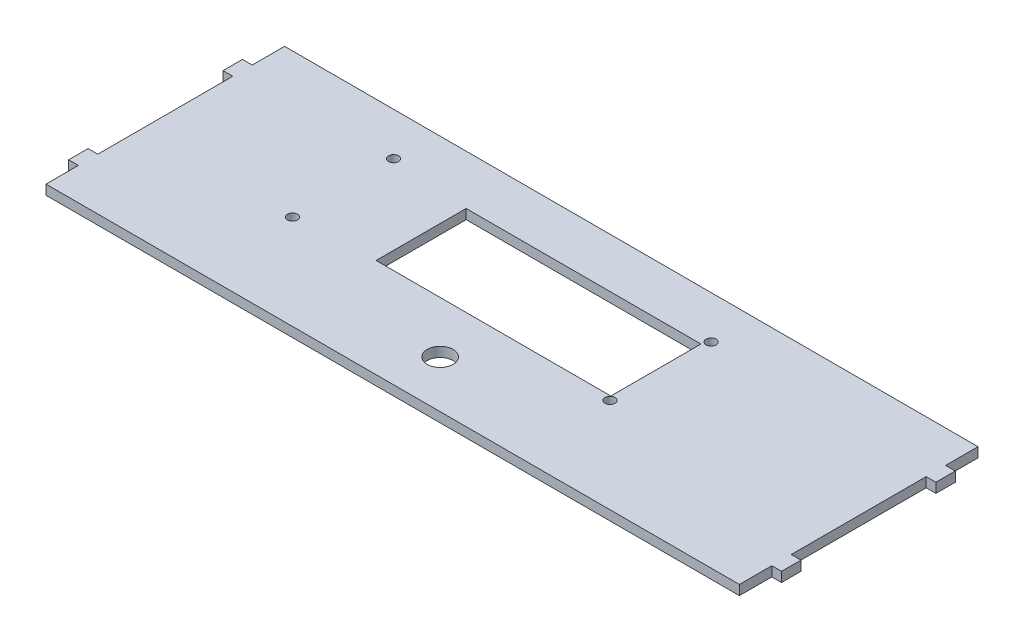
ISO-10303-21;
HEADER;
FILE_DESCRIPTION(('STEP AP214'),'2;1');
FILE_NAME('part.step','',(''),(''),'','','');
FILE_SCHEMA(('AUTOMOTIVE_DESIGN { 1 0 10303 214 1 1 1 1 }'));
ENDSEC;
DATA;
#1=APPLICATION_CONTEXT('core data for automotive mechanical design processes');
#2=APPLICATION_PROTOCOL_DEFINITION('international standard','automotive_design',2000,#1);
#3=PRODUCT_CONTEXT('',#1,'mechanical');
#4=PRODUCT('Part','Part','',(#3));
#5=PRODUCT_RELATED_PRODUCT_CATEGORY('part','',(#4));
#6=PRODUCT_DEFINITION_FORMATION('','',#4);
#7=PRODUCT_DEFINITION_CONTEXT('part definition',#1,'design');
#8=PRODUCT_DEFINITION('design','',#6,#7);
#9=PRODUCT_DEFINITION_SHAPE('','',#8);
#10=(LENGTH_UNIT() NAMED_UNIT(*) SI_UNIT(.MILLI.,.METRE.));
#11=(NAMED_UNIT(*) PLANE_ANGLE_UNIT() SI_UNIT($,.RADIAN.));
#12=(NAMED_UNIT(*) SI_UNIT($,.STERADIAN.) SOLID_ANGLE_UNIT());
#13=UNCERTAINTY_MEASURE_WITH_UNIT(LENGTH_MEASURE(1.E-05),#10,'distance_accuracy_value','');
#14=(GEOMETRIC_REPRESENTATION_CONTEXT(3) GLOBAL_UNCERTAINTY_ASSIGNED_CONTEXT((#13)) GLOBAL_UNIT_ASSIGNED_CONTEXT((#10,
#11,#12)) REPRESENTATION_CONTEXT('',''));
#15=CARTESIAN_POINT('',(0.,0.,0.));
#16=DIRECTION('',(0.,0.,1.));
#17=DIRECTION('',(1.,0.,0.));
#18=AXIS2_PLACEMENT_3D('',#15,#16,#17);
#19=CARTESIAN_POINT('',(107.,3.,-36.82));
#20=DIRECTION('',(-1.,0.,0.));
#21=DIRECTION('',(0.,0.,1.));
#22=AXIS2_PLACEMENT_3D('',#19,#20,#21);
#23=PLANE('',#22);
#24=DIRECTION('',(0.,0.,-1.));
#25=VECTOR('',#24,1.);
#26=CARTESIAN_POINT('',(107.,3.,-36.82));
#27=LINE('',#26,#25);
#28=CARTESIAN_POINT('',(107.,3.,20.82));
#29=VERTEX_POINT('',#28);
#30=CARTESIAN_POINT('',(107.,3.,-20.82));
#31=VERTEX_POINT('',#30);
#32=EDGE_CURVE('E302',#29,#31,#27,.T.);
#33=ORIENTED_EDGE('',*,*,#32,.F.);
#34=DIRECTION('',(0.,1.,0.));
#35=VECTOR('',#34,1.);
#36=CARTESIAN_POINT('',(107.,0.,20.82));
#37=LINE('',#36,#35);
#38=CARTESIAN_POINT('',(107.,0.,20.82));
#39=VERTEX_POINT('',#38);
#40=EDGE_CURVE('E260',#39,#29,#37,.T.);
#41=ORIENTED_EDGE('',*,*,#40,.F.);
#42=DIRECTION('',(0.,0.,-1.));
#43=VECTOR('',#42,1.);
#44=CARTESIAN_POINT('',(107.,0.,-36.82));
#45=LINE('',#44,#43);
#46=CARTESIAN_POINT('',(107.,0.,-20.82));
#47=VERTEX_POINT('',#46);
#48=EDGE_CURVE('E297',#39,#47,#45,.T.);
#49=ORIENTED_EDGE('',*,*,#48,.T.);
#50=DIRECTION('',(0.,1.,0.));
#51=VECTOR('',#50,1.);
#52=CARTESIAN_POINT('',(107.,0.,-20.82));
#53=LINE('',#52,#51);
#54=EDGE_CURVE('E290',#47,#31,#53,.T.);
#55=ORIENTED_EDGE('',*,*,#54,.T.);
#56=EDGE_LOOP('',(#33,#41,#49,#55));
#57=FACE_BOUND('',#56,.T.);
#58=ADVANCED_FACE('F32',(#57),#23,.F.);
#59=DIRECTION('',(0.,1.,0.));
#60=VECTOR('',#59,1.);
#61=CARTESIAN_POINT('',(107.,0.,-26.82));
#62=LINE('',#61,#60);
#63=CARTESIAN_POINT('',(107.,0.,-26.82));
#64=VERTEX_POINT('',#63);
#65=CARTESIAN_POINT('',(107.,3.,-26.82));
#66=VERTEX_POINT('',#65);
#67=EDGE_CURVE('E283',#64,#66,#62,.T.);
#68=ORIENTED_EDGE('',*,*,#67,.F.);
#69=CARTESIAN_POINT('',(107.,0.,-36.82));
#70=VERTEX_POINT('',#69);
#71=EDGE_CURVE('E301',#64,#70,#45,.T.);
#72=ORIENTED_EDGE('',*,*,#71,.T.);
#73=DIRECTION('',(0.,-1.,0.));
#74=VECTOR('',#73,1.);
#75=CARTESIAN_POINT('',(107.,3.,-36.82));
#76=LINE('',#75,#74);
#77=CARTESIAN_POINT('',(107.,3.,-36.82));
#78=VERTEX_POINT('',#77);
#79=EDGE_CURVE('E353',#78,#70,#76,.T.);
#80=ORIENTED_EDGE('',*,*,#79,.F.);
#81=EDGE_CURVE('E344',#66,#78,#27,.T.);
#82=ORIENTED_EDGE('',*,*,#81,.F.);
#83=EDGE_LOOP('',(#68,#72,#80,#82));
#84=FACE_BOUND('',#83,.T.);
#85=ADVANCED_FACE('F384',(#84),#23,.F.);
#86=CARTESIAN_POINT('',(-107.,3.,-36.82));
#87=DIRECTION('',(1.,0.,0.));
#88=DIRECTION('',(0.,0.,-1.));
#89=AXIS2_PLACEMENT_3D('',#86,#87,#88);
#90=PLANE('',#89);
#91=DIRECTION('',(0.,0.,1.));
#92=VECTOR('',#91,1.);
#93=CARTESIAN_POINT('',(-107.,3.,-36.82));
#94=LINE('',#93,#92);
#95=CARTESIAN_POINT('',(-107.,3.,26.82));
#96=VERTEX_POINT('',#95);
#97=CARTESIAN_POINT('',(-107.,3.,36.82));
#98=VERTEX_POINT('',#97);
#99=EDGE_CURVE('E318',#96,#98,#94,.T.);
#100=ORIENTED_EDGE('',*,*,#99,.F.);
#101=DIRECTION('',(0.,1.,0.));
#102=VECTOR('',#101,1.);
#103=CARTESIAN_POINT('',(-107.,0.,26.82));
#104=LINE('',#103,#102);
#105=CARTESIAN_POINT('',(-107.,0.,26.82));
#106=VERTEX_POINT('',#105);
#107=EDGE_CURVE('E469',#106,#96,#104,.T.);
#108=ORIENTED_EDGE('',*,*,#107,.F.);
#109=DIRECTION('',(0.,0.,1.));
#110=VECTOR('',#109,1.);
#111=CARTESIAN_POINT('',(-107.,0.,-36.82));
#112=LINE('',#111,#110);
#113=CARTESIAN_POINT('',(-107.,0.,36.82));
#114=VERTEX_POINT('',#113);
#115=EDGE_CURVE('E322',#106,#114,#112,.T.);
#116=ORIENTED_EDGE('',*,*,#115,.T.);
#117=DIRECTION('',(0.,-1.,0.));
#118=VECTOR('',#117,1.);
#119=CARTESIAN_POINT('',(-107.,3.,36.82));
#120=LINE('',#119,#118);
#121=EDGE_CURVE('E348',#98,#114,#120,.T.);
#122=ORIENTED_EDGE('',*,*,#121,.F.);
#123=EDGE_LOOP('',(#100,#108,#116,#122));
#124=FACE_BOUND('',#123,.T.);
#125=ADVANCED_FACE('F389',(#124),#90,.F.);
#126=CARTESIAN_POINT('',(-107.,0.,-20.82));
#127=VERTEX_POINT('',#126);
#128=CARTESIAN_POINT('',(-107.,0.,20.82));
#129=VERTEX_POINT('',#128);
#130=EDGE_CURVE('E334',#127,#129,#112,.T.);
#131=ORIENTED_EDGE('',*,*,#130,.T.);
#132=DIRECTION('',(0.,1.,0.));
#133=VECTOR('',#132,1.);
#134=CARTESIAN_POINT('',(-107.,0.,20.82));
#135=LINE('',#134,#133);
#136=CARTESIAN_POINT('',(-107.,3.,20.82));
#137=VERTEX_POINT('',#136);
#138=EDGE_CURVE('E485',#129,#137,#135,.T.);
#139=ORIENTED_EDGE('',*,*,#138,.T.);
#140=CARTESIAN_POINT('',(-107.,3.,-20.82));
#141=VERTEX_POINT('',#140);
#142=EDGE_CURVE('E320',#141,#137,#94,.T.);
#143=ORIENTED_EDGE('',*,*,#142,.F.);
#144=DIRECTION('',(0.,1.,0.));
#145=VECTOR('',#144,1.);
#146=CARTESIAN_POINT('',(-107.,0.,-20.82));
#147=LINE('',#146,#145);
#148=EDGE_CURVE('E446',#127,#141,#147,.T.);
#149=ORIENTED_EDGE('',*,*,#148,.F.);
#150=EDGE_LOOP('',(#131,#139,#143,#149));
#151=FACE_BOUND('',#150,.T.);
#152=ADVANCED_FACE('F393',(#151),#90,.F.);
#153=CARTESIAN_POINT('',(107.,0.,36.82));
#154=VERTEX_POINT('',#153);
#155=CARTESIAN_POINT('',(107.,0.,26.82));
#156=VERTEX_POINT('',#155);
#157=EDGE_CURVE('E300',#154,#156,#45,.T.);
#158=ORIENTED_EDGE('',*,*,#157,.T.);
#159=DIRECTION('',(0.,1.,0.));
#160=VECTOR('',#159,1.);
#161=CARTESIAN_POINT('',(107.,0.,26.82));
#162=LINE('',#161,#160);
#163=CARTESIAN_POINT('',(107.,3.,26.82));
#164=VERTEX_POINT('',#163);
#165=EDGE_CURVE('E251',#156,#164,#162,.T.);
#166=ORIENTED_EDGE('',*,*,#165,.T.);
#167=CARTESIAN_POINT('',(107.,3.,36.82));
#168=VERTEX_POINT('',#167);
#169=EDGE_CURVE('E420',#168,#164,#27,.T.);
#170=ORIENTED_EDGE('',*,*,#169,.F.);
#171=DIRECTION('',(0.,-1.,0.));
#172=VECTOR('',#171,1.);
#173=CARTESIAN_POINT('',(107.,3.,36.82));
#174=LINE('',#173,#172);
#175=EDGE_CURVE('E345',#168,#154,#174,.T.);
#176=ORIENTED_EDGE('',*,*,#175,.T.);
#177=EDGE_LOOP('',(#158,#166,#170,#176));
#178=FACE_BOUND('',#177,.T.);
#179=ADVANCED_FACE('F34',(#178),#23,.F.);
#180=CARTESIAN_POINT('',(-107.,3.,-36.82));
#181=DIRECTION('',(0.,0.,1.));
#182=DIRECTION('',(1.,0.,0.));
#183=AXIS2_PLACEMENT_3D('',#180,#181,#182);
#184=PLANE('',#183);
#185=DIRECTION('',(-1.,0.,0.));
#186=VECTOR('',#185,1.);
#187=CARTESIAN_POINT('',(-107.,0.,-36.82));
#188=LINE('',#187,#186);
#189=CARTESIAN_POINT('',(-107.,0.,-36.82));
#190=VERTEX_POINT('',#189);
#191=EDGE_CURVE('E310',#70,#190,#188,.T.);
#192=ORIENTED_EDGE('',*,*,#191,.T.);
#193=DIRECTION('',(0.,-1.,0.));
#194=VECTOR('',#193,1.);
#195=CARTESIAN_POINT('',(-107.,3.,-36.82));
#196=LINE('',#195,#194);
#197=CARTESIAN_POINT('',(-107.,3.,-36.82));
#198=VERTEX_POINT('',#197);
#199=EDGE_CURVE('E351',#198,#190,#196,.T.);
#200=ORIENTED_EDGE('',*,*,#199,.F.);
#201=DIRECTION('',(-1.,0.,0.));
#202=VECTOR('',#201,1.);
#203=CARTESIAN_POINT('',(-107.,3.,-36.82));
#204=LINE('',#203,#202);
#205=EDGE_CURVE('E321',#78,#198,#204,.T.);
#206=ORIENTED_EDGE('',*,*,#205,.F.);
#207=ORIENTED_EDGE('',*,*,#79,.T.);
#208=EDGE_LOOP('',(#192,#200,#206,#207));
#209=FACE_BOUND('',#208,.T.);
#210=ADVANCED_FACE('F392',(#209),#184,.F.);
#211=CARTESIAN_POINT('',(-107.,0.,-26.82));
#212=VERTEX_POINT('',#211);
#213=EDGE_CURVE('E336',#190,#212,#112,.T.);
#214=ORIENTED_EDGE('',*,*,#213,.T.);
#215=DIRECTION('',(0.,1.,0.));
#216=VECTOR('',#215,1.);
#217=CARTESIAN_POINT('',(-107.,0.,-26.82));
#218=LINE('',#217,#216);
#219=CARTESIAN_POINT('',(-107.,3.,-26.82));
#220=VERTEX_POINT('',#219);
#221=EDGE_CURVE('E433',#212,#220,#218,.T.);
#222=ORIENTED_EDGE('',*,*,#221,.T.);
#223=EDGE_CURVE('E331',#198,#220,#94,.T.);
#224=ORIENTED_EDGE('',*,*,#223,.F.);
#225=ORIENTED_EDGE('',*,*,#199,.T.);
#226=EDGE_LOOP('',(#214,#222,#224,#225));
#227=FACE_BOUND('',#226,.T.);
#228=ADVANCED_FACE('F399',(#227),#90,.F.);
#229=CARTESIAN_POINT('',(-107.,3.,36.82));
#230=DIRECTION('',(0.,0.,-1.));
#231=DIRECTION('',(-1.,0.,0.));
#232=AXIS2_PLACEMENT_3D('',#229,#230,#231);
#233=PLANE('',#232);
#234=DIRECTION('',(1.,0.,0.));
#235=VECTOR('',#234,1.);
#236=CARTESIAN_POINT('',(-107.,0.,36.82));
#237=LINE('',#236,#235);
#238=EDGE_CURVE('E340',#114,#154,#237,.T.);
#239=ORIENTED_EDGE('',*,*,#238,.T.);
#240=ORIENTED_EDGE('',*,*,#175,.F.);
#241=DIRECTION('',(1.,0.,0.));
#242=VECTOR('',#241,1.);
#243=CARTESIAN_POINT('',(-107.,3.,36.82));
#244=LINE('',#243,#242);
#245=EDGE_CURVE('E308',#98,#168,#244,.T.);
#246=ORIENTED_EDGE('',*,*,#245,.F.);
#247=ORIENTED_EDGE('',*,*,#121,.T.);
#248=EDGE_LOOP('',(#239,#240,#246,#247));
#249=FACE_BOUND('',#248,.T.);
#250=ADVANCED_FACE('F520',(#249),#233,.F.);
#251=CARTESIAN_POINT('',(0.,3.,0.));
#252=DIRECTION('',(0.,1.,0.));
#253=DIRECTION('',(0.,0.,1.));
#254=AXIS2_PLACEMENT_3D('',#251,#252,#253);
#255=PLANE('',#254);
#256=DIRECTION('',(0.,0.,1.));
#257=VECTOR('',#256,1.);
#258=CARTESIAN_POINT('',(-35.65,3.,-21.5049942070807));
#259=LINE('',#258,#257);
#260=CARTESIAN_POINT('',(-35.65,3.,-21.5049942070807));
#261=VERTEX_POINT('',#260);
#262=CARTESIAN_POINT('',(-35.65,3.,6.29500579291932));
#263=VERTEX_POINT('',#262);
#264=EDGE_CURVE('E47',#261,#263,#259,.T.);
#265=ORIENTED_EDGE('',*,*,#264,.F.);
#266=DIRECTION('',(-1.,0.,0.));
#267=VECTOR('',#266,1.);
#268=CARTESIAN_POINT('',(-35.65,3.,-21.5049942070807));
#269=LINE('',#268,#267);
#270=CARTESIAN_POINT('',(36.8,3.,-21.5049942070807));
#271=VERTEX_POINT('',#270);
#272=EDGE_CURVE('E212',#271,#261,#269,.T.);
#273=ORIENTED_EDGE('',*,*,#272,.F.);
#274=DIRECTION('',(0.,0.,-1.));
#275=VECTOR('',#274,1.);
#276=CARTESIAN_POINT('',(36.8,3.,-21.5049942070807));
#277=LINE('',#276,#275);
#278=CARTESIAN_POINT('',(36.8,3.,6.29500579291932));
#279=VERTEX_POINT('',#278);
#280=EDGE_CURVE('E196',#279,#271,#277,.T.);
#281=ORIENTED_EDGE('',*,*,#280,.F.);
#282=DIRECTION('',(1.,0.,0.));
#283=VECTOR('',#282,1.);
#284=CARTESIAN_POINT('',(-35.65,3.,6.29500579291932));
#285=LINE('',#284,#283);
#286=EDGE_CURVE('E205',#263,#279,#285,.T.);
#287=ORIENTED_EDGE('',*,*,#286,.F.);
#288=EDGE_LOOP('',(#265,#273,#281,#287));
#289=FACE_BOUND('',#288,.T.);
#290=CARTESIAN_POINT('',(-60.15,3.,7.59500579291931));
#291=DIRECTION('',(0.,1.,0.));
#292=DIRECTION('',(0.,0.,1.));
#293=AXIS2_PLACEMENT_3D('',#290,#291,#292);
#294=CIRCLE('',#293,1.55);
#295=CARTESIAN_POINT('',(-60.15,3.,9.14500579291931));
#296=VERTEX_POINT('',#295);
#297=EDGE_CURVE('E219',#296,#296,#294,.T.);
#298=ORIENTED_EDGE('',*,*,#297,.F.);
#299=EDGE_LOOP('',(#298));
#300=FACE_BOUND('',#299,.T.);
#301=CARTESIAN_POINT('',(37.85,3.,7.59500579291931));
#302=DIRECTION('',(0.,1.,0.));
#303=DIRECTION('',(0.,0.,1.));
#304=AXIS2_PLACEMENT_3D('',#301,#302,#303);
#305=CIRCLE('',#304,1.55);
#306=CARTESIAN_POINT('',(37.85,3.,9.14500579291931));
#307=VERTEX_POINT('',#306);
#308=EDGE_CURVE('E225',#307,#307,#305,.T.);
#309=ORIENTED_EDGE('',*,*,#308,.F.);
#310=EDGE_LOOP('',(#309));
#311=FACE_BOUND('',#310,.T.);
#312=CARTESIAN_POINT('',(37.85,3.,-23.6049942070807));
#313=DIRECTION('',(0.,1.,0.));
#314=DIRECTION('',(0.,0.,1.));
#315=AXIS2_PLACEMENT_3D('',#312,#313,#314);
#316=CIRCLE('',#315,1.55);
#317=CARTESIAN_POINT('',(37.85,3.,-22.0549942070807));
#318=VERTEX_POINT('',#317);
#319=EDGE_CURVE('E229',#318,#318,#316,.T.);
#320=ORIENTED_EDGE('',*,*,#319,.F.);
#321=EDGE_LOOP('',(#320));
#322=FACE_BOUND('',#321,.T.);
#323=CARTESIAN_POINT('',(-60.15,3.,-23.6049942070807));
#324=DIRECTION('',(0.,1.,0.));
#325=DIRECTION('',(0.,0.,1.));
#326=AXIS2_PLACEMENT_3D('',#323,#324,#325);
#327=CIRCLE('',#326,1.55);
#328=CARTESIAN_POINT('',(-60.15,3.,-22.0549942070807));
#329=VERTEX_POINT('',#328);
#330=EDGE_CURVE('E233',#329,#329,#327,.T.);
#331=ORIENTED_EDGE('',*,*,#330,.F.);
#332=EDGE_LOOP('',(#331));
#333=FACE_BOUND('',#332,.T.);
#334=CARTESIAN_POINT('',(0.,3.,22.18));
#335=DIRECTION('',(0.,1.,0.));
#336=DIRECTION('',(0.,0.,1.));
#337=AXIS2_PLACEMENT_3D('',#334,#335,#336);
#338=CIRCLE('',#337,4.);
#339=CARTESIAN_POINT('',(0.,3.,26.18));
#340=VERTEX_POINT('',#339);
#341=EDGE_CURVE('E237',#340,#340,#338,.T.);
#342=ORIENTED_EDGE('',*,*,#341,.F.);
#343=EDGE_LOOP('',(#342));
#344=FACE_BOUND('',#343,.T.);
#345=ORIENTED_EDGE('',*,*,#169,.T.);
#346=DIRECTION('',(1.,0.,0.));
#347=VECTOR('',#346,1.);
#348=CARTESIAN_POINT('',(107.,3.,26.82));
#349=LINE('',#348,#347);
#350=CARTESIAN_POINT('',(110.,3.,26.82));
#351=VERTEX_POINT('',#350);
#352=EDGE_CURVE('E252',#164,#351,#349,.T.);
#353=ORIENTED_EDGE('',*,*,#352,.T.);
#354=DIRECTION('',(0.,0.,-1.));
#355=VECTOR('',#354,1.);
#356=CARTESIAN_POINT('',(110.,3.,20.82));
#357=LINE('',#356,#355);
#358=CARTESIAN_POINT('',(110.,3.,20.82));
#359=VERTEX_POINT('',#358);
#360=EDGE_CURVE('E255',#351,#359,#357,.T.);
#361=ORIENTED_EDGE('',*,*,#360,.T.);
#362=DIRECTION('',(-1.,0.,0.));
#363=VECTOR('',#362,1.);
#364=CARTESIAN_POINT('',(107.,3.,20.82));
#365=LINE('',#364,#363);
#366=EDGE_CURVE('E245',#359,#29,#365,.T.);
#367=ORIENTED_EDGE('',*,*,#366,.T.);
#368=ORIENTED_EDGE('',*,*,#32,.T.);
#369=DIRECTION('',(1.,0.,0.));
#370=VECTOR('',#369,1.);
#371=CARTESIAN_POINT('',(107.,3.,-20.82));
#372=LINE('',#371,#370);
#373=CARTESIAN_POINT('',(110.,3.,-20.82));
#374=VERTEX_POINT('',#373);
#375=EDGE_CURVE('E263',#31,#374,#372,.T.);
#376=ORIENTED_EDGE('',*,*,#375,.T.);
#377=DIRECTION('',(0.,0.,-1.));
#378=VECTOR('',#377,1.);
#379=CARTESIAN_POINT('',(110.,3.,-26.82));
#380=LINE('',#379,#378);
#381=CARTESIAN_POINT('',(110.,3.,-26.82));
#382=VERTEX_POINT('',#381);
#383=EDGE_CURVE('E274',#374,#382,#380,.T.);
#384=ORIENTED_EDGE('',*,*,#383,.T.);
#385=DIRECTION('',(-1.,0.,0.));
#386=VECTOR('',#385,1.);
#387=CARTESIAN_POINT('',(107.,3.,-26.82));
#388=LINE('',#387,#386);
#389=EDGE_CURVE('E277',#382,#66,#388,.T.);
#390=ORIENTED_EDGE('',*,*,#389,.T.);
#391=ORIENTED_EDGE('',*,*,#81,.T.);
#392=ORIENTED_EDGE('',*,*,#205,.T.);
#393=ORIENTED_EDGE('',*,*,#223,.T.);
#394=DIRECTION('',(-1.,0.,0.));
#395=VECTOR('',#394,1.);
#396=CARTESIAN_POINT('',(-107.,3.,-26.82));
#397=LINE('',#396,#395);
#398=CARTESIAN_POINT('',(-110.,3.,-26.82));
#399=VERTEX_POINT('',#398);
#400=EDGE_CURVE('E462',#220,#399,#397,.T.);
#401=ORIENTED_EDGE('',*,*,#400,.T.);
#402=DIRECTION('',(0.,0.,1.));
#403=VECTOR('',#402,1.);
#404=CARTESIAN_POINT('',(-110.,3.,-26.82));
#405=LINE('',#404,#403);
#406=CARTESIAN_POINT('',(-110.,3.,-20.82));
#407=VERTEX_POINT('',#406);
#408=EDGE_CURVE('E453',#399,#407,#405,.T.);
#409=ORIENTED_EDGE('',*,*,#408,.T.);
#410=DIRECTION('',(1.,0.,0.));
#411=VECTOR('',#410,1.);
#412=CARTESIAN_POINT('',(-107.,3.,-20.82));
#413=LINE('',#412,#411);
#414=EDGE_CURVE('E443',#407,#141,#413,.T.);
#415=ORIENTED_EDGE('',*,*,#414,.T.);
#416=ORIENTED_EDGE('',*,*,#142,.T.);
#417=DIRECTION('',(-1.,0.,0.));
#418=VECTOR('',#417,1.);
#419=CARTESIAN_POINT('',(-107.,3.,20.82));
#420=LINE('',#419,#418);
#421=CARTESIAN_POINT('',(-110.,3.,20.82));
#422=VERTEX_POINT('',#421);
#423=EDGE_CURVE('E286',#137,#422,#420,.T.);
#424=ORIENTED_EDGE('',*,*,#423,.T.);
#425=DIRECTION('',(0.,0.,1.));
#426=VECTOR('',#425,1.);
#427=CARTESIAN_POINT('',(-110.,3.,26.82));
#428=LINE('',#427,#426);
#429=CARTESIAN_POINT('',(-110.,3.,26.82));
#430=VERTEX_POINT('',#429);
#431=EDGE_CURVE('E505',#422,#430,#428,.T.);
#432=ORIENTED_EDGE('',*,*,#431,.T.);
#433=DIRECTION('',(1.,0.,0.));
#434=VECTOR('',#433,1.);
#435=CARTESIAN_POINT('',(-107.,3.,26.82));
#436=LINE('',#435,#434);
#437=EDGE_CURVE('E481',#430,#96,#436,.T.);
#438=ORIENTED_EDGE('',*,*,#437,.T.);
#439=ORIENTED_EDGE('',*,*,#99,.T.);
#440=ORIENTED_EDGE('',*,*,#245,.T.);
#441=EDGE_LOOP('',(#345,#353,#361,#367,#368,#376,#384,#390,#391,#392,#393,#401,#409,#415,#416,
#424,#432,#438,#439,#440));
#442=FACE_BOUND('',#441,.T.);
#443=ADVANCED_FACE('F209',(#289,#300,#311,#322,#333,#344,#442),#255,.T.);
#444=CARTESIAN_POINT('',(0.,0.,0.));
#445=DIRECTION('',(0.,1.,0.));
#446=DIRECTION('',(0.,0.,1.));
#447=AXIS2_PLACEMENT_3D('',#444,#445,#446);
#448=PLANE('',#447);
#449=DIRECTION('',(-1.,0.,0.));
#450=VECTOR('',#449,1.);
#451=CARTESIAN_POINT('',(0.,0.,-21.5049942070807));
#452=LINE('',#451,#450);
#453=CARTESIAN_POINT('',(36.8,0.,-21.5049942070807));
#454=VERTEX_POINT('',#453);
#455=CARTESIAN_POINT('',(-35.65,0.,-21.5049942070807));
#456=VERTEX_POINT('',#455);
#457=EDGE_CURVE('E40',#454,#456,#452,.T.);
#458=ORIENTED_EDGE('',*,*,#457,.T.);
#459=DIRECTION('',(0.,0.,1.));
#460=VECTOR('',#459,1.);
#461=CARTESIAN_POINT('',(-35.65,0.,0.));
#462=LINE('',#461,#460);
#463=CARTESIAN_POINT('',(-35.65,0.,6.29500579291932));
#464=VERTEX_POINT('',#463);
#465=EDGE_CURVE('E11',#456,#464,#462,.T.);
#466=ORIENTED_EDGE('',*,*,#465,.T.);
#467=DIRECTION('',(1.,0.,0.));
#468=VECTOR('',#467,1.);
#469=CARTESIAN_POINT('',(0.,0.,6.29500579291932));
#470=LINE('',#469,#468);
#471=CARTESIAN_POINT('',(36.8,0.,6.29500579291932));
#472=VERTEX_POINT('',#471);
#473=EDGE_CURVE('E355',#464,#472,#470,.T.);
#474=ORIENTED_EDGE('',*,*,#473,.T.);
#475=DIRECTION('',(0.,0.,-1.));
#476=VECTOR('',#475,1.);
#477=CARTESIAN_POINT('',(36.8,0.,0.));
#478=LINE('',#477,#476);
#479=EDGE_CURVE('E199',#472,#454,#478,.T.);
#480=ORIENTED_EDGE('',*,*,#479,.T.);
#481=EDGE_LOOP('',(#458,#466,#474,#480));
#482=FACE_BOUND('',#481,.T.);
#483=CARTESIAN_POINT('',(-60.15,0.,7.59500579291931));
#484=DIRECTION('',(0.,1.,0.));
#485=DIRECTION('',(0.,0.,1.));
#486=AXIS2_PLACEMENT_3D('',#483,#484,#485);
#487=CIRCLE('',#486,1.55);
#488=CARTESIAN_POINT('',(-60.15,0.,9.14500579291931));
#489=VERTEX_POINT('',#488);
#490=EDGE_CURVE('E224',#489,#489,#487,.T.);
#491=ORIENTED_EDGE('',*,*,#490,.T.);
#492=EDGE_LOOP('',(#491));
#493=FACE_BOUND('',#492,.T.);
#494=CARTESIAN_POINT('',(37.85,0.,7.59500579291931));
#495=DIRECTION('',(0.,1.,0.));
#496=DIRECTION('',(0.,0.,1.));
#497=AXIS2_PLACEMENT_3D('',#494,#495,#496);
#498=CIRCLE('',#497,1.55);
#499=CARTESIAN_POINT('',(37.85,0.,9.14500579291931));
#500=VERTEX_POINT('',#499);
#501=EDGE_CURVE('E228',#500,#500,#498,.T.);
#502=ORIENTED_EDGE('',*,*,#501,.T.);
#503=EDGE_LOOP('',(#502));
#504=FACE_BOUND('',#503,.T.);
#505=CARTESIAN_POINT('',(37.85,0.,-23.6049942070807));
#506=DIRECTION('',(0.,1.,0.));
#507=DIRECTION('',(0.,0.,1.));
#508=AXIS2_PLACEMENT_3D('',#505,#506,#507);
#509=CIRCLE('',#508,1.55);
#510=CARTESIAN_POINT('',(37.85,0.,-22.0549942070807));
#511=VERTEX_POINT('',#510);
#512=EDGE_CURVE('E232',#511,#511,#509,.T.);
#513=ORIENTED_EDGE('',*,*,#512,.T.);
#514=EDGE_LOOP('',(#513));
#515=FACE_BOUND('',#514,.T.);
#516=CARTESIAN_POINT('',(-60.15,0.,-23.6049942070807));
#517=DIRECTION('',(0.,1.,0.));
#518=DIRECTION('',(0.,0.,1.));
#519=AXIS2_PLACEMENT_3D('',#516,#517,#518);
#520=CIRCLE('',#519,1.55);
#521=CARTESIAN_POINT('',(-60.15,0.,-22.0549942070807));
#522=VERTEX_POINT('',#521);
#523=EDGE_CURVE('E236',#522,#522,#520,.T.);
#524=ORIENTED_EDGE('',*,*,#523,.T.);
#525=EDGE_LOOP('',(#524));
#526=FACE_BOUND('',#525,.T.);
#527=CARTESIAN_POINT('',(0.,0.,22.18));
#528=DIRECTION('',(0.,1.,0.));
#529=DIRECTION('',(0.,0.,1.));
#530=AXIS2_PLACEMENT_3D('',#527,#528,#529);
#531=CIRCLE('',#530,4.);
#532=CARTESIAN_POINT('',(0.,0.,26.18));
#533=VERTEX_POINT('',#532);
#534=EDGE_CURVE('E240',#533,#533,#531,.T.);
#535=ORIENTED_EDGE('',*,*,#534,.T.);
#536=EDGE_LOOP('',(#535));
#537=FACE_BOUND('',#536,.T.);
#538=ORIENTED_EDGE('',*,*,#157,.F.);
#539=ORIENTED_EDGE('',*,*,#238,.F.);
#540=ORIENTED_EDGE('',*,*,#115,.F.);
#541=DIRECTION('',(1.,0.,0.));
#542=VECTOR('',#541,1.);
#543=CARTESIAN_POINT('',(-107.,0.,26.82));
#544=LINE('',#543,#542);
#545=CARTESIAN_POINT('',(-110.,0.,26.82));
#546=VERTEX_POINT('',#545);
#547=EDGE_CURVE('E486',#546,#106,#544,.T.);
#548=ORIENTED_EDGE('',*,*,#547,.F.);
#549=DIRECTION('',(0.,0.,1.));
#550=VECTOR('',#549,1.);
#551=CARTESIAN_POINT('',(-110.,0.,26.82));
#552=LINE('',#551,#550);
#553=CARTESIAN_POINT('',(-110.,0.,20.82));
#554=VERTEX_POINT('',#553);
#555=EDGE_CURVE('E501',#554,#546,#552,.T.);
#556=ORIENTED_EDGE('',*,*,#555,.F.);
#557=DIRECTION('',(-1.,0.,0.));
#558=VECTOR('',#557,1.);
#559=CARTESIAN_POINT('',(-107.,0.,20.82));
#560=LINE('',#559,#558);
#561=EDGE_CURVE('E498',#129,#554,#560,.T.);
#562=ORIENTED_EDGE('',*,*,#561,.F.);
#563=ORIENTED_EDGE('',*,*,#130,.F.);
#564=DIRECTION('',(1.,0.,0.));
#565=VECTOR('',#564,1.);
#566=CARTESIAN_POINT('',(-107.,0.,-20.82));
#567=LINE('',#566,#565);
#568=CARTESIAN_POINT('',(-110.,0.,-20.82));
#569=VERTEX_POINT('',#568);
#570=EDGE_CURVE('E437',#569,#127,#567,.T.);
#571=ORIENTED_EDGE('',*,*,#570,.F.);
#572=DIRECTION('',(0.,0.,1.));
#573=VECTOR('',#572,1.);
#574=CARTESIAN_POINT('',(-110.,0.,-26.82));
#575=LINE('',#574,#573);
#576=CARTESIAN_POINT('',(-110.,0.,-26.82));
#577=VERTEX_POINT('',#576);
#578=EDGE_CURVE('E442',#577,#569,#575,.T.);
#579=ORIENTED_EDGE('',*,*,#578,.F.);
#580=DIRECTION('',(-1.,0.,0.));
#581=VECTOR('',#580,1.);
#582=CARTESIAN_POINT('',(-107.,0.,-26.82));
#583=LINE('',#582,#581);
#584=EDGE_CURVE('E439',#212,#577,#583,.T.);
#585=ORIENTED_EDGE('',*,*,#584,.F.);
#586=ORIENTED_EDGE('',*,*,#213,.F.);
#587=ORIENTED_EDGE('',*,*,#191,.F.);
#588=ORIENTED_EDGE('',*,*,#71,.F.);
#589=DIRECTION('',(-1.,0.,0.));
#590=VECTOR('',#589,1.);
#591=CARTESIAN_POINT('',(107.,0.,-26.82));
#592=LINE('',#591,#590);
#593=CARTESIAN_POINT('',(110.,0.,-26.82));
#594=VERTEX_POINT('',#593);
#595=EDGE_CURVE('E272',#594,#64,#592,.T.);
#596=ORIENTED_EDGE('',*,*,#595,.F.);
#597=DIRECTION('',(0.,0.,-1.));
#598=VECTOR('',#597,1.);
#599=CARTESIAN_POINT('',(110.,0.,-26.82));
#600=LINE('',#599,#598);
#601=CARTESIAN_POINT('',(110.,0.,-20.82));
#602=VERTEX_POINT('',#601);
#603=EDGE_CURVE('E269',#602,#594,#600,.T.);
#604=ORIENTED_EDGE('',*,*,#603,.F.);
#605=DIRECTION('',(1.,0.,0.));
#606=VECTOR('',#605,1.);
#607=CARTESIAN_POINT('',(107.,0.,-20.82));
#608=LINE('',#607,#606);
#609=EDGE_CURVE('E273',#47,#602,#608,.T.);
#610=ORIENTED_EDGE('',*,*,#609,.F.);
#611=ORIENTED_EDGE('',*,*,#48,.F.);
#612=DIRECTION('',(-1.,0.,0.));
#613=VECTOR('',#612,1.);
#614=CARTESIAN_POINT('',(107.,0.,20.82));
#615=LINE('',#614,#613);
#616=CARTESIAN_POINT('',(110.,0.,20.82));
#617=VERTEX_POINT('',#616);
#618=EDGE_CURVE('E248',#617,#39,#615,.T.);
#619=ORIENTED_EDGE('',*,*,#618,.F.);
#620=DIRECTION('',(0.,0.,-1.));
#621=VECTOR('',#620,1.);
#622=CARTESIAN_POINT('',(110.,0.,20.82));
#623=LINE('',#622,#621);
#624=CARTESIAN_POINT('',(110.,0.,26.82));
#625=VERTEX_POINT('',#624);
#626=EDGE_CURVE('E244',#625,#617,#623,.T.);
#627=ORIENTED_EDGE('',*,*,#626,.F.);
#628=DIRECTION('',(1.,0.,0.));
#629=VECTOR('',#628,1.);
#630=CARTESIAN_POINT('',(107.,0.,26.82));
#631=LINE('',#630,#629);
#632=EDGE_CURVE('E241',#156,#625,#631,.T.);
#633=ORIENTED_EDGE('',*,*,#632,.F.);
#634=EDGE_LOOP('',(#538,#539,#540,#548,#556,#562,#563,#571,#579,#585,#586,#587,#588,#596,#604,
#610,#611,#619,#627,#633));
#635=FACE_BOUND('',#634,.T.);
#636=ADVANCED_FACE('F365',(#482,#493,#504,#515,#526,#537,#635),#448,.F.);
#637=CARTESIAN_POINT('',(-107.,0.,-20.82));
#638=DIRECTION('',(0.,0.,1.));
#639=DIRECTION('',(1.,0.,0.));
#640=AXIS2_PLACEMENT_3D('',#637,#638,#639);
#641=PLANE('',#640);
#642=ORIENTED_EDGE('',*,*,#414,.F.);
#643=DIRECTION('',(0.,1.,0.));
#644=VECTOR('',#643,1.);
#645=CARTESIAN_POINT('',(-110.,0.,-20.82));
#646=LINE('',#645,#644);
#647=EDGE_CURVE('E449',#569,#407,#646,.T.);
#648=ORIENTED_EDGE('',*,*,#647,.F.);
#649=ORIENTED_EDGE('',*,*,#570,.T.);
#650=ORIENTED_EDGE('',*,*,#148,.T.);
#651=EDGE_LOOP('',(#642,#648,#649,#650));
#652=FACE_BOUND('',#651,.T.);
#653=ADVANCED_FACE('F490',(#652),#641,.T.);
#654=CARTESIAN_POINT('',(-110.,0.,-26.82));
#655=DIRECTION('',(-1.,0.,0.));
#656=DIRECTION('',(0.,0.,1.));
#657=AXIS2_PLACEMENT_3D('',#654,#655,#656);
#658=PLANE('',#657);
#659=ORIENTED_EDGE('',*,*,#408,.F.);
#660=DIRECTION('',(0.,1.,0.));
#661=VECTOR('',#660,1.);
#662=CARTESIAN_POINT('',(-110.,0.,-26.82));
#663=LINE('',#662,#661);
#664=EDGE_CURVE('E430',#577,#399,#663,.T.);
#665=ORIENTED_EDGE('',*,*,#664,.F.);
#666=ORIENTED_EDGE('',*,*,#578,.T.);
#667=ORIENTED_EDGE('',*,*,#647,.T.);
#668=EDGE_LOOP('',(#659,#665,#666,#667));
#669=FACE_BOUND('',#668,.T.);
#670=ADVANCED_FACE('F465',(#669),#658,.T.);
#671=CARTESIAN_POINT('',(-107.,0.,-26.82));
#672=DIRECTION('',(0.,0.,-1.));
#673=DIRECTION('',(-1.,0.,0.));
#674=AXIS2_PLACEMENT_3D('',#671,#672,#673);
#675=PLANE('',#674);
#676=ORIENTED_EDGE('',*,*,#400,.F.);
#677=ORIENTED_EDGE('',*,*,#221,.F.);
#678=ORIENTED_EDGE('',*,*,#584,.T.);
#679=ORIENTED_EDGE('',*,*,#664,.T.);
#680=EDGE_LOOP('',(#676,#677,#678,#679));
#681=FACE_BOUND('',#680,.T.);
#682=ADVANCED_FACE('F460',(#681),#675,.T.);
#683=CARTESIAN_POINT('',(-107.,0.,26.82));
#684=DIRECTION('',(0.,0.,1.));
#685=DIRECTION('',(1.,0.,0.));
#686=AXIS2_PLACEMENT_3D('',#683,#684,#685);
#687=PLANE('',#686);
#688=ORIENTED_EDGE('',*,*,#437,.F.);
#689=DIRECTION('',(0.,1.,0.));
#690=VECTOR('',#689,1.);
#691=CARTESIAN_POINT('',(-110.,0.,26.82));
#692=LINE('',#691,#690);
#693=EDGE_CURVE('E471',#546,#430,#692,.T.);
#694=ORIENTED_EDGE('',*,*,#693,.F.);
#695=ORIENTED_EDGE('',*,*,#547,.T.);
#696=ORIENTED_EDGE('',*,*,#107,.T.);
#697=EDGE_LOOP('',(#688,#694,#695,#696));
#698=FACE_BOUND('',#697,.T.);
#699=ADVANCED_FACE('F515',(#698),#687,.T.);
#700=CARTESIAN_POINT('',(-110.,0.,26.82));
#701=DIRECTION('',(-1.,0.,0.));
#702=DIRECTION('',(0.,0.,1.));
#703=AXIS2_PLACEMENT_3D('',#700,#701,#702);
#704=PLANE('',#703);
#705=ORIENTED_EDGE('',*,*,#431,.F.);
#706=DIRECTION('',(0.,1.,0.));
#707=VECTOR('',#706,1.);
#708=CARTESIAN_POINT('',(-110.,0.,20.82));
#709=LINE('',#708,#707);
#710=EDGE_CURVE('E478',#554,#422,#709,.T.);
#711=ORIENTED_EDGE('',*,*,#710,.F.);
#712=ORIENTED_EDGE('',*,*,#555,.T.);
#713=ORIENTED_EDGE('',*,*,#693,.T.);
#714=EDGE_LOOP('',(#705,#711,#712,#713));
#715=FACE_BOUND('',#714,.T.);
#716=ADVANCED_FACE('F516',(#715),#704,.T.);
#717=CARTESIAN_POINT('',(-107.,0.,20.82));
#718=DIRECTION('',(0.,0.,-1.));
#719=DIRECTION('',(-1.,0.,0.));
#720=AXIS2_PLACEMENT_3D('',#717,#718,#719);
#721=PLANE('',#720);
#722=ORIENTED_EDGE('',*,*,#423,.F.);
#723=ORIENTED_EDGE('',*,*,#138,.F.);
#724=ORIENTED_EDGE('',*,*,#561,.T.);
#725=ORIENTED_EDGE('',*,*,#710,.T.);
#726=EDGE_LOOP('',(#722,#723,#724,#725));
#727=FACE_BOUND('',#726,.T.);
#728=ADVANCED_FACE('F538',(#727),#721,.T.);
#729=CARTESIAN_POINT('',(107.,0.,-26.82));
#730=DIRECTION('',(0.,0.,-1.));
#731=DIRECTION('',(-1.,0.,0.));
#732=AXIS2_PLACEMENT_3D('',#729,#730,#731);
#733=PLANE('',#732);
#734=ORIENTED_EDGE('',*,*,#389,.F.);
#735=DIRECTION('',(0.,1.,0.));
#736=VECTOR('',#735,1.);
#737=CARTESIAN_POINT('',(110.,0.,-26.82));
#738=LINE('',#737,#736);
#739=EDGE_CURVE('E280',#594,#382,#738,.T.);
#740=ORIENTED_EDGE('',*,*,#739,.F.);
#741=ORIENTED_EDGE('',*,*,#595,.T.);
#742=ORIENTED_EDGE('',*,*,#67,.T.);
#743=EDGE_LOOP('',(#734,#740,#741,#742));
#744=FACE_BOUND('',#743,.T.);
#745=ADVANCED_FACE('F541',(#744),#733,.T.);
#746=CARTESIAN_POINT('',(110.,0.,-26.82));
#747=DIRECTION('',(1.,0.,0.));
#748=DIRECTION('',(0.,0.,-1.));
#749=AXIS2_PLACEMENT_3D('',#746,#747,#748);
#750=PLANE('',#749);
#751=ORIENTED_EDGE('',*,*,#383,.F.);
#752=DIRECTION('',(0.,1.,0.));
#753=VECTOR('',#752,1.);
#754=CARTESIAN_POINT('',(110.,0.,-20.82));
#755=LINE('',#754,#753);
#756=EDGE_CURVE('E818',#602,#374,#755,.T.);
#757=ORIENTED_EDGE('',*,*,#756,.F.);
#758=ORIENTED_EDGE('',*,*,#603,.T.);
#759=ORIENTED_EDGE('',*,*,#739,.T.);
#760=EDGE_LOOP('',(#751,#757,#758,#759));
#761=FACE_BOUND('',#760,.T.);
#762=ADVANCED_FACE('F550',(#761),#750,.T.);
#763=CARTESIAN_POINT('',(107.,0.,-20.82));
#764=DIRECTION('',(0.,0.,1.));
#765=DIRECTION('',(1.,0.,0.));
#766=AXIS2_PLACEMENT_3D('',#763,#764,#765);
#767=PLANE('',#766);
#768=ORIENTED_EDGE('',*,*,#375,.F.);
#769=ORIENTED_EDGE('',*,*,#54,.F.);
#770=ORIENTED_EDGE('',*,*,#609,.T.);
#771=ORIENTED_EDGE('',*,*,#756,.T.);
#772=EDGE_LOOP('',(#768,#769,#770,#771));
#773=FACE_BOUND('',#772,.T.);
#774=ADVANCED_FACE('F546',(#773),#767,.T.);
#775=CARTESIAN_POINT('',(107.,0.,20.82));
#776=DIRECTION('',(0.,0.,-1.));
#777=DIRECTION('',(-1.,0.,0.));
#778=AXIS2_PLACEMENT_3D('',#775,#776,#777);
#779=PLANE('',#778);
#780=ORIENTED_EDGE('',*,*,#366,.F.);
#781=DIRECTION('',(0.,1.,0.));
#782=VECTOR('',#781,1.);
#783=CARTESIAN_POINT('',(110.,0.,20.82));
#784=LINE('',#783,#782);
#785=EDGE_CURVE('E264',#617,#359,#784,.T.);
#786=ORIENTED_EDGE('',*,*,#785,.F.);
#787=ORIENTED_EDGE('',*,*,#618,.T.);
#788=ORIENTED_EDGE('',*,*,#40,.T.);
#789=EDGE_LOOP('',(#780,#786,#787,#788));
#790=FACE_BOUND('',#789,.T.);
#791=ADVANCED_FACE('F549',(#790),#779,.T.);
#792=CARTESIAN_POINT('',(110.,0.,20.82));
#793=DIRECTION('',(1.,0.,0.));
#794=DIRECTION('',(0.,0.,-1.));
#795=AXIS2_PLACEMENT_3D('',#792,#793,#794);
#796=PLANE('',#795);
#797=ORIENTED_EDGE('',*,*,#360,.F.);
#798=DIRECTION('',(0.,1.,0.));
#799=VECTOR('',#798,1.);
#800=CARTESIAN_POINT('',(110.,0.,26.82));
#801=LINE('',#800,#799);
#802=EDGE_CURVE('E266',#625,#351,#801,.T.);
#803=ORIENTED_EDGE('',*,*,#802,.F.);
#804=ORIENTED_EDGE('',*,*,#626,.T.);
#805=ORIENTED_EDGE('',*,*,#785,.T.);
#806=EDGE_LOOP('',(#797,#803,#804,#805));
#807=FACE_BOUND('',#806,.T.);
#808=ADVANCED_FACE('F417',(#807),#796,.T.);
#809=CARTESIAN_POINT('',(107.,0.,26.82));
#810=DIRECTION('',(0.,0.,1.));
#811=DIRECTION('',(1.,0.,0.));
#812=AXIS2_PLACEMENT_3D('',#809,#810,#811);
#813=PLANE('',#812);
#814=ORIENTED_EDGE('',*,*,#352,.F.);
#815=ORIENTED_EDGE('',*,*,#165,.F.);
#816=ORIENTED_EDGE('',*,*,#632,.T.);
#817=ORIENTED_EDGE('',*,*,#802,.T.);
#818=EDGE_LOOP('',(#814,#815,#816,#817));
#819=FACE_BOUND('',#818,.T.);
#820=ADVANCED_FACE('F412',(#819),#813,.T.);
#821=CARTESIAN_POINT('',(0.,-5.00000000001367E-05,22.18));
#822=DIRECTION('',(0.,1.,0.));
#823=DIRECTION('',(0.,0.,1.));
#824=AXIS2_PLACEMENT_3D('',#821,#822,#823);
#825=CYLINDRICAL_SURFACE('',#824,4.);
#826=ORIENTED_EDGE('',*,*,#341,.T.);
#827=EDGE_LOOP('',(#826));
#828=FACE_BOUND('',#827,.T.);
#829=ORIENTED_EDGE('',*,*,#534,.F.);
#830=EDGE_LOOP('',(#829));
#831=FACE_BOUND('',#830,.T.);
#832=ADVANCED_FACE('F560',(#828,#831),#825,.F.);
#833=CARTESIAN_POINT('',(-60.15,-5.00000000001367E-05,-23.6049942070807));
#834=DIRECTION('',(0.,1.,0.));
#835=DIRECTION('',(0.,0.,1.));
#836=AXIS2_PLACEMENT_3D('',#833,#834,#835);
#837=CYLINDRICAL_SURFACE('',#836,1.55);
#838=ORIENTED_EDGE('',*,*,#330,.T.);
#839=EDGE_LOOP('',(#838));
#840=FACE_BOUND('',#839,.T.);
#841=ORIENTED_EDGE('',*,*,#523,.F.);
#842=EDGE_LOOP('',(#841));
#843=FACE_BOUND('',#842,.T.);
#844=ADVANCED_FACE('F568',(#840,#843),#837,.F.);
#845=CARTESIAN_POINT('',(37.85,-5.00000000001367E-05,-23.6049942070807));
#846=DIRECTION('',(0.,1.,0.));
#847=DIRECTION('',(0.,0.,1.));
#848=AXIS2_PLACEMENT_3D('',#845,#846,#847);
#849=CYLINDRICAL_SURFACE('',#848,1.55);
#850=ORIENTED_EDGE('',*,*,#319,.T.);
#851=EDGE_LOOP('',(#850));
#852=FACE_BOUND('',#851,.T.);
#853=ORIENTED_EDGE('',*,*,#512,.F.);
#854=EDGE_LOOP('',(#853));
#855=FACE_BOUND('',#854,.T.);
#856=ADVANCED_FACE('F572',(#852,#855),#849,.F.);
#857=CARTESIAN_POINT('',(37.85,-5.00000000001367E-05,7.59500579291931));
#858=DIRECTION('',(0.,1.,0.));
#859=DIRECTION('',(0.,0.,1.));
#860=AXIS2_PLACEMENT_3D('',#857,#858,#859);
#861=CYLINDRICAL_SURFACE('',#860,1.55);
#862=ORIENTED_EDGE('',*,*,#308,.T.);
#863=EDGE_LOOP('',(#862));
#864=FACE_BOUND('',#863,.T.);
#865=ORIENTED_EDGE('',*,*,#501,.F.);
#866=EDGE_LOOP('',(#865));
#867=FACE_BOUND('',#866,.T.);
#868=ADVANCED_FACE('F379',(#864,#867),#861,.F.);
#869=CARTESIAN_POINT('',(-60.15,-5.00000000001367E-05,7.59500579291931));
#870=DIRECTION('',(0.,1.,0.));
#871=DIRECTION('',(0.,0.,1.));
#872=AXIS2_PLACEMENT_3D('',#869,#870,#871);
#873=CYLINDRICAL_SURFACE('',#872,1.55);
#874=ORIENTED_EDGE('',*,*,#297,.T.);
#875=EDGE_LOOP('',(#874));
#876=FACE_BOUND('',#875,.T.);
#877=ORIENTED_EDGE('',*,*,#490,.F.);
#878=EDGE_LOOP('',(#877));
#879=FACE_BOUND('',#878,.T.);
#880=ADVANCED_FACE('F372',(#876,#879),#873,.F.);
#881=CARTESIAN_POINT('',(-35.65,-5.00000000001367E-05,-21.5049942070807));
#882=DIRECTION('',(-1.,0.,0.));
#883=DIRECTION('',(0.,0.,1.));
#884=AXIS2_PLACEMENT_3D('',#881,#882,#883);
#885=PLANE('',#884);
#886=DIRECTION('',(0.,1.,0.));
#887=VECTOR('',#886,1.);
#888=CARTESIAN_POINT('',(-35.65,-5.00000000001367E-05,-21.5049942070807));
#889=LINE('',#888,#887);
#890=EDGE_CURVE('E217',#456,#261,#889,.T.);
#891=ORIENTED_EDGE('',*,*,#890,.T.);
#892=ORIENTED_EDGE('',*,*,#264,.T.);
#893=DIRECTION('',(0.,1.,0.));
#894=VECTOR('',#893,1.);
#895=CARTESIAN_POINT('',(-35.65,-5.00000000001367E-05,6.29500579291932));
#896=LINE('',#895,#894);
#897=EDGE_CURVE('E202',#464,#263,#896,.T.);
#898=ORIENTED_EDGE('',*,*,#897,.F.);
#899=ORIENTED_EDGE('',*,*,#465,.F.);
#900=EDGE_LOOP('',(#891,#892,#898,#899));
#901=FACE_BOUND('',#900,.T.);
#902=ADVANCED_FACE('F370',(#901),#885,.F.);
#903=CARTESIAN_POINT('',(-35.65,-5.00000000001367E-05,-21.5049942070807));
#904=DIRECTION('',(0.,0.,-1.));
#905=DIRECTION('',(-1.,0.,0.));
#906=AXIS2_PLACEMENT_3D('',#903,#904,#905);
#907=PLANE('',#906);
#908=DIRECTION('',(0.,1.,0.));
#909=VECTOR('',#908,1.);
#910=CARTESIAN_POINT('',(36.8,-5.00000000001367E-05,-21.5049942070807));
#911=LINE('',#910,#909);
#912=EDGE_CURVE('E201',#454,#271,#911,.T.);
#913=ORIENTED_EDGE('',*,*,#912,.T.);
#914=ORIENTED_EDGE('',*,*,#272,.T.);
#915=ORIENTED_EDGE('',*,*,#890,.F.);
#916=ORIENTED_EDGE('',*,*,#457,.F.);
#917=EDGE_LOOP('',(#913,#914,#915,#916));
#918=FACE_BOUND('',#917,.T.);
#919=ADVANCED_FACE('F369',(#918),#907,.F.);
#920=CARTESIAN_POINT('',(36.8,-5.00000000001367E-05,-21.5049942070807));
#921=DIRECTION('',(1.,0.,0.));
#922=DIRECTION('',(0.,0.,-1.));
#923=AXIS2_PLACEMENT_3D('',#920,#921,#922);
#924=PLANE('',#923);
#925=DIRECTION('',(0.,1.,0.));
#926=VECTOR('',#925,1.);
#927=CARTESIAN_POINT('',(36.8,-5.00000000001367E-05,6.29500579291932));
#928=LINE('',#927,#926);
#929=EDGE_CURVE('E55',#472,#279,#928,.T.);
#930=ORIENTED_EDGE('',*,*,#929,.T.);
#931=ORIENTED_EDGE('',*,*,#280,.T.);
#932=ORIENTED_EDGE('',*,*,#912,.F.);
#933=ORIENTED_EDGE('',*,*,#479,.F.);
#934=EDGE_LOOP('',(#930,#931,#932,#933));
#935=FACE_BOUND('',#934,.T.);
#936=ADVANCED_FACE('F193',(#935),#924,.F.);
#937=CARTESIAN_POINT('',(-35.65,-5.00000000001367E-05,6.29500579291932));
#938=DIRECTION('',(0.,0.,1.));
#939=DIRECTION('',(1.,0.,0.));
#940=AXIS2_PLACEMENT_3D('',#937,#938,#939);
#941=PLANE('',#940);
#942=ORIENTED_EDGE('',*,*,#897,.T.);
#943=ORIENTED_EDGE('',*,*,#286,.T.);
#944=ORIENTED_EDGE('',*,*,#929,.F.);
#945=ORIENTED_EDGE('',*,*,#473,.F.);
#946=EDGE_LOOP('',(#942,#943,#944,#945));
#947=FACE_BOUND('',#946,.T.);
#948=ADVANCED_FACE('F206',(#947),#941,.F.);
#949=CLOSED_SHELL('',(#58,#85,#125,#152,#179,#210,#228,#250,#443,#636,#653,#670,#682,#699,#716,
#728,#745,#762,#774,#791,#808,#820,#832,#844,#856,#868,#880,#902,#919,#936,#948));
#950=MANIFOLD_SOLID_BREP('B2',#949);
#951=ADVANCED_BREP_SHAPE_REPRESENTATION('',(#18,#950),#14);
#952=SHAPE_DEFINITION_REPRESENTATION(#9,#951);
ENDSEC;
END-ISO-10303-21;
